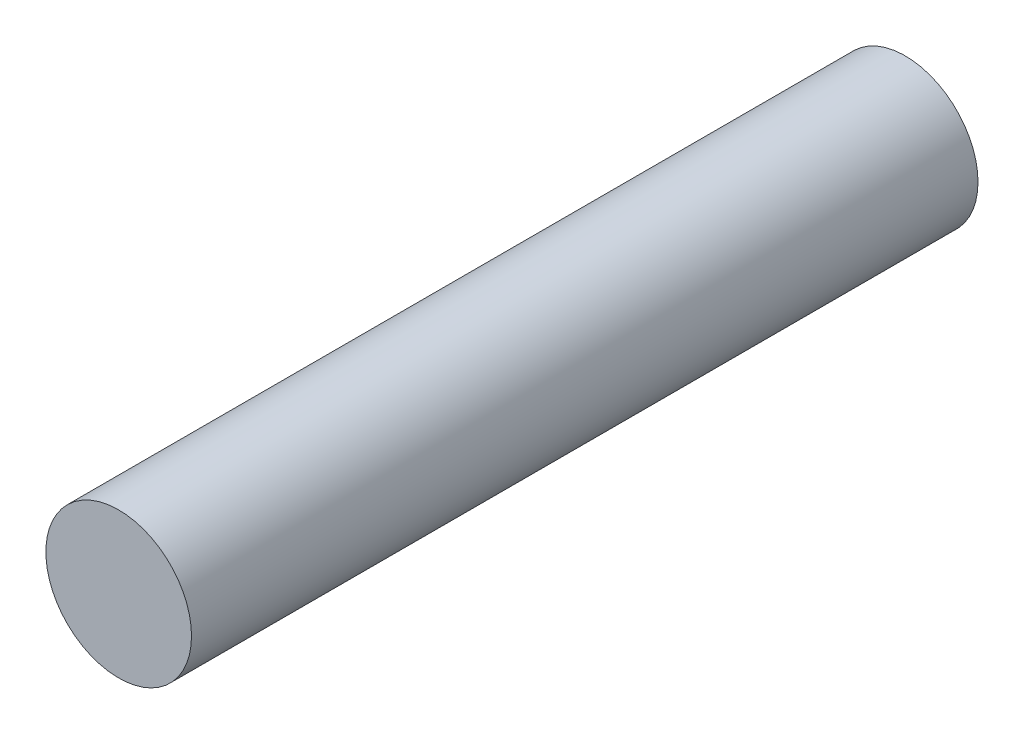
ISO-10303-21;
HEADER;
FILE_DESCRIPTION(('STEP AP214'),'2;1');
FILE_NAME('part.step','',(''),(''),'','','');
FILE_SCHEMA(('AUTOMOTIVE_DESIGN { 1 0 10303 214 1 1 1 1 }'));
ENDSEC;
DATA;
#1=APPLICATION_CONTEXT('core data for automotive mechanical design processes');
#2=APPLICATION_PROTOCOL_DEFINITION('international standard','automotive_design',2000,#1);
#3=PRODUCT_CONTEXT('',#1,'mechanical');
#4=PRODUCT('Part','Part','',(#3));
#5=PRODUCT_RELATED_PRODUCT_CATEGORY('part','',(#4));
#6=PRODUCT_DEFINITION_FORMATION('','',#4);
#7=PRODUCT_DEFINITION_CONTEXT('part definition',#1,'design');
#8=PRODUCT_DEFINITION('design','',#6,#7);
#9=PRODUCT_DEFINITION_SHAPE('','',#8);
#10=(LENGTH_UNIT() NAMED_UNIT(*) SI_UNIT(.MILLI.,.METRE.));
#11=(NAMED_UNIT(*) PLANE_ANGLE_UNIT() SI_UNIT($,.RADIAN.));
#12=(NAMED_UNIT(*) SI_UNIT($,.STERADIAN.) SOLID_ANGLE_UNIT());
#13=UNCERTAINTY_MEASURE_WITH_UNIT(LENGTH_MEASURE(1.E-05),#10,'distance_accuracy_value','');
#14=(GEOMETRIC_REPRESENTATION_CONTEXT(3) GLOBAL_UNCERTAINTY_ASSIGNED_CONTEXT((#13)) GLOBAL_UNIT_ASSIGNED_CONTEXT((#10,
#11,#12)) REPRESENTATION_CONTEXT('',''));
#15=CARTESIAN_POINT('',(0.,0.,0.));
#16=DIRECTION('',(0.,0.,1.));
#17=DIRECTION('',(1.,0.,0.));
#18=AXIS2_PLACEMENT_3D('',#15,#16,#17);
#19=CARTESIAN_POINT('',(0.,0.,135.));
#20=DIRECTION('',(0.,0.,-1.));
#21=DIRECTION('',(-1.,0.,0.));
#22=AXIS2_PLACEMENT_3D('',#19,#20,#21);
#23=CYLINDRICAL_SURFACE('',#22,12.5);
#24=CARTESIAN_POINT('',(0.,0.,135.));
#25=DIRECTION('',(0.,0.,1.));
#26=DIRECTION('',(1.,0.,0.));
#27=AXIS2_PLACEMENT_3D('',#24,#25,#26);
#28=CIRCLE('',#27,12.5);
#29=CARTESIAN_POINT('',(12.5,0.,135.));
#30=VERTEX_POINT('',#29);
#31=EDGE_CURVE('E10',#30,#30,#28,.T.);
#32=ORIENTED_EDGE('',*,*,#31,.F.);
#33=EDGE_LOOP('',(#32));
#34=FACE_BOUND('',#33,.T.);
#35=CARTESIAN_POINT('',(0.,0.,0.));
#36=DIRECTION('',(0.,0.,1.));
#37=DIRECTION('',(1.,0.,0.));
#38=AXIS2_PLACEMENT_3D('',#35,#36,#37);
#39=CIRCLE('',#38,12.5);
#40=CARTESIAN_POINT('',(12.5,0.,0.));
#41=VERTEX_POINT('',#40);
#42=EDGE_CURVE('E35',#41,#41,#39,.T.);
#43=ORIENTED_EDGE('',*,*,#42,.T.);
#44=EDGE_LOOP('',(#43));
#45=FACE_BOUND('',#44,.T.);
#46=ADVANCED_FACE('F32',(#34,#45),#23,.T.);
#47=CARTESIAN_POINT('',(0.,0.,135.));
#48=DIRECTION('',(0.,0.,1.));
#49=DIRECTION('',(1.,0.,0.));
#50=AXIS2_PLACEMENT_3D('',#47,#48,#49);
#51=PLANE('',#50);
#52=ORIENTED_EDGE('',*,*,#31,.T.);
#53=EDGE_LOOP('',(#52));
#54=FACE_BOUND('',#53,.T.);
#55=ADVANCED_FACE('F47',(#54),#51,.T.);
#56=CARTESIAN_POINT('',(0.,0.,0.));
#57=DIRECTION('',(0.,0.,1.));
#58=DIRECTION('',(1.,0.,0.));
#59=AXIS2_PLACEMENT_3D('',#56,#57,#58);
#60=PLANE('',#59);
#61=ORIENTED_EDGE('',*,*,#42,.F.);
#62=EDGE_LOOP('',(#61));
#63=FACE_BOUND('',#62,.T.);
#64=ADVANCED_FACE('F45',(#63),#60,.F.);
#65=CLOSED_SHELL('',(#46,#55,#64));
#66=MANIFOLD_SOLID_BREP('B2',#65);
#67=ADVANCED_BREP_SHAPE_REPRESENTATION('',(#18,#66),#14);
#68=SHAPE_DEFINITION_REPRESENTATION(#9,#67);
ENDSEC;
END-ISO-10303-21;
